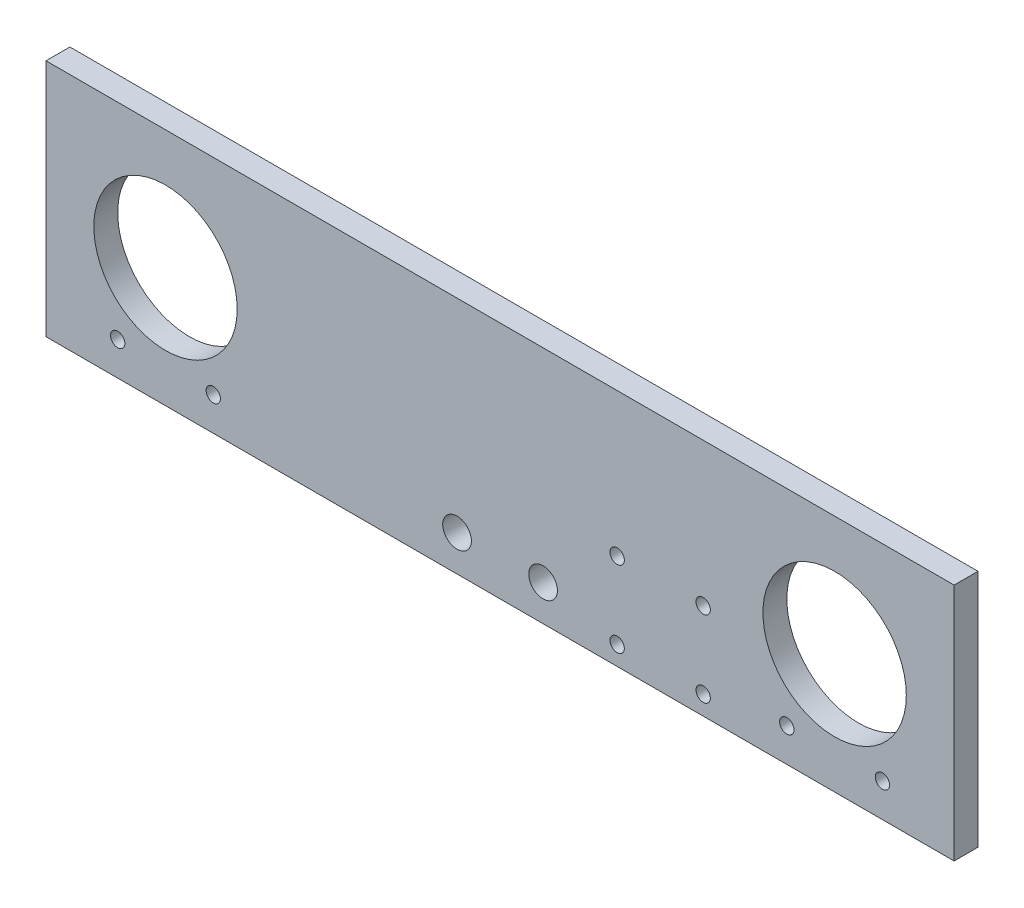
ISO-10303-21;
HEADER;
FILE_DESCRIPTION(('STEP AP214'),'2;1');
FILE_NAME('part.step','',(''),(''),'','','');
FILE_SCHEMA(('AUTOMOTIVE_DESIGN { 1 0 10303 214 1 1 1 1 }'));
ENDSEC;
DATA;
#1=APPLICATION_CONTEXT('core data for automotive mechanical design processes');
#2=APPLICATION_PROTOCOL_DEFINITION('international standard','automotive_design',2000,#1);
#3=PRODUCT_CONTEXT('',#1,'mechanical');
#4=PRODUCT('Part','Part','',(#3));
#5=PRODUCT_RELATED_PRODUCT_CATEGORY('part','',(#4));
#6=PRODUCT_DEFINITION_FORMATION('','',#4);
#7=PRODUCT_DEFINITION_CONTEXT('part definition',#1,'design');
#8=PRODUCT_DEFINITION('design','',#6,#7);
#9=PRODUCT_DEFINITION_SHAPE('','',#8);
#10=(LENGTH_UNIT() NAMED_UNIT(*) SI_UNIT(.MILLI.,.METRE.));
#11=(NAMED_UNIT(*) PLANE_ANGLE_UNIT() SI_UNIT($,.RADIAN.));
#12=(NAMED_UNIT(*) SI_UNIT($,.STERADIAN.) SOLID_ANGLE_UNIT());
#13=UNCERTAINTY_MEASURE_WITH_UNIT(LENGTH_MEASURE(1.E-05),#10,'distance_accuracy_value','');
#14=(GEOMETRIC_REPRESENTATION_CONTEXT(3) GLOBAL_UNCERTAINTY_ASSIGNED_CONTEXT((#13)) GLOBAL_UNIT_ASSIGNED_CONTEXT((#10,
#11,#12)) REPRESENTATION_CONTEXT('',''));
#15=CARTESIAN_POINT('',(0.,0.,0.));
#16=DIRECTION('',(0.,0.,1.));
#17=DIRECTION('',(1.,0.,0.));
#18=AXIS2_PLACEMENT_3D('',#15,#16,#17);
#19=CARTESIAN_POINT('',(0.,0.,0.));
#20=DIRECTION('',(0.,0.,1.));
#21=DIRECTION('',(1.,0.,0.));
#22=AXIS2_PLACEMENT_3D('',#19,#20,#21);
#23=PLANE('',#22);
#24=CARTESIAN_POINT('',(155.,7.,0.));
#25=DIRECTION('',(0.,0.,1.));
#26=DIRECTION('',(1.,0.,0.));
#27=AXIS2_PLACEMENT_3D('',#24,#25,#26);
#28=CIRCLE('',#27,2.75000000000001);
#29=CARTESIAN_POINT('',(157.75,7.,0.));
#30=VERTEX_POINT('',#29);
#31=EDGE_CURVE('E154',#30,#30,#28,.T.);
#32=ORIENTED_EDGE('',*,*,#31,.T.);
#33=EDGE_LOOP('',(#32));
#34=FACE_BOUND('',#33,.T.);
#35=CARTESIAN_POINT('',(15.,7.,0.));
#36=DIRECTION('',(0.,0.,1.));
#37=DIRECTION('',(1.,0.,0.));
#38=AXIS2_PLACEMENT_3D('',#35,#36,#37);
#39=CIRCLE('',#38,2.75);
#40=CARTESIAN_POINT('',(17.75,7.,0.));
#41=VERTEX_POINT('',#40);
#42=EDGE_CURVE('E143',#41,#41,#39,.T.);
#43=ORIENTED_EDGE('',*,*,#42,.T.);
#44=EDGE_LOOP('',(#43));
#45=FACE_BOUND('',#44,.T.);
#46=CARTESIAN_POINT('',(137.5,20.,0.));
#47=DIRECTION('',(0.,0.,1.));
#48=DIRECTION('',(1.,0.,0.));
#49=AXIS2_PLACEMENT_3D('',#46,#47,#48);
#50=CIRCLE('',#49,1.5);
#51=CARTESIAN_POINT('',(139.,20.,0.));
#52=VERTEX_POINT('',#51);
#53=EDGE_CURVE('E102',#52,#52,#50,.T.);
#54=ORIENTED_EDGE('',*,*,#53,.T.);
#55=EDGE_LOOP('',(#54));
#56=FACE_BOUND('',#55,.T.);
#57=CARTESIAN_POINT('',(119.5,20.,0.));
#58=DIRECTION('',(0.,0.,1.));
#59=DIRECTION('',(1.,0.,0.));
#60=AXIS2_PLACEMENT_3D('',#57,#58,#59);
#61=CIRCLE('',#60,1.5);
#62=CARTESIAN_POINT('',(121.,20.,0.));
#63=VERTEX_POINT('',#62);
#64=EDGE_CURVE('E105',#63,#63,#61,.T.);
#65=ORIENTED_EDGE('',*,*,#64,.T.);
#66=EDGE_LOOP('',(#65));
#67=FACE_BOUND('',#66,.T.);
#68=CARTESIAN_POINT('',(119.5,4.,0.));
#69=DIRECTION('',(0.,0.,1.));
#70=DIRECTION('',(1.,0.,0.));
#71=AXIS2_PLACEMENT_3D('',#68,#69,#70);
#72=CIRCLE('',#71,1.5);
#73=CARTESIAN_POINT('',(121.,4.,0.));
#74=VERTEX_POINT('',#73);
#75=EDGE_CURVE('E109',#74,#74,#72,.T.);
#76=ORIENTED_EDGE('',*,*,#75,.T.);
#77=EDGE_LOOP('',(#76));
#78=FACE_BOUND('',#77,.T.);
#79=CARTESIAN_POINT('',(104.,7.5,0.));
#80=DIRECTION('',(0.,0.,1.));
#81=DIRECTION('',(1.,0.,0.));
#82=AXIS2_PLACEMENT_3D('',#79,#80,#81);
#83=CIRCLE('',#82,3.00000000000001);
#84=CARTESIAN_POINT('',(107.,7.5,0.));
#85=VERTEX_POINT('',#84);
#86=EDGE_CURVE('E112',#85,#85,#83,.T.);
#87=ORIENTED_EDGE('',*,*,#86,.T.);
#88=EDGE_LOOP('',(#87));
#89=FACE_BOUND('',#88,.T.);
#90=CARTESIAN_POINT('',(86.,7.5,0.));
#91=DIRECTION('',(0.,0.,1.));
#92=DIRECTION('',(1.,0.,0.));
#93=AXIS2_PLACEMENT_3D('',#90,#91,#92);
#94=CIRCLE('',#93,3.00000000000001);
#95=CARTESIAN_POINT('',(89.,7.5,0.));
#96=VERTEX_POINT('',#95);
#97=EDGE_CURVE('E115',#96,#96,#94,.T.);
#98=ORIENTED_EDGE('',*,*,#97,.T.);
#99=EDGE_LOOP('',(#98));
#100=FACE_BOUND('',#99,.T.);
#101=CARTESIAN_POINT('',(137.5,4.,0.));
#102=DIRECTION('',(0.,0.,1.));
#103=DIRECTION('',(1.,0.,0.));
#104=AXIS2_PLACEMENT_3D('',#101,#102,#103);
#105=CIRCLE('',#104,1.5);
#106=CARTESIAN_POINT('',(139.,4.,0.));
#107=VERTEX_POINT('',#106);
#108=EDGE_CURVE('E118',#107,#107,#105,.T.);
#109=ORIENTED_EDGE('',*,*,#108,.T.);
#110=EDGE_LOOP('',(#109));
#111=FACE_BOUND('',#110,.T.);
#112=CARTESIAN_POINT('',(165.,25.,0.));
#113=DIRECTION('',(0.,0.,1.));
#114=DIRECTION('',(1.,0.,0.));
#115=AXIS2_PLACEMENT_3D('',#112,#113,#114);
#116=CIRCLE('',#115,15.);
#117=CARTESIAN_POINT('',(180.,25.,0.));
#118=VERTEX_POINT('',#117);
#119=EDGE_CURVE('E121',#118,#118,#116,.T.);
#120=ORIENTED_EDGE('',*,*,#119,.T.);
#121=EDGE_LOOP('',(#120));
#122=FACE_BOUND('',#121,.T.);
#123=CARTESIAN_POINT('',(25.,25.,0.));
#124=DIRECTION('',(0.,0.,1.));
#125=DIRECTION('',(1.,0.,0.));
#126=AXIS2_PLACEMENT_3D('',#123,#124,#125);
#127=CIRCLE('',#126,15.);
#128=CARTESIAN_POINT('',(40.,25.,0.));
#129=VERTEX_POINT('',#128);
#130=EDGE_CURVE('E124',#129,#129,#127,.T.);
#131=ORIENTED_EDGE('',*,*,#130,.T.);
#132=EDGE_LOOP('',(#131));
#133=FACE_BOUND('',#132,.T.);
#134=DIRECTION('',(1.,0.,0.));
#135=VECTOR('',#134,1.);
#136=CARTESIAN_POINT('',(0.,0.,0.));
#137=LINE('',#136,#135);
#138=CARTESIAN_POINT('',(0.,0.,0.));
#139=VERTEX_POINT('',#138);
#140=CARTESIAN_POINT('',(190.,0.,0.));
#141=VERTEX_POINT('',#140);
#142=EDGE_CURVE('E127',#139,#141,#137,.T.);
#143=ORIENTED_EDGE('',*,*,#142,.F.);
#144=DIRECTION('',(0.,1.,0.));
#145=VECTOR('',#144,1.);
#146=CARTESIAN_POINT('',(0.,0.,0.));
#147=LINE('',#146,#145);
#148=CARTESIAN_POINT('',(0.,50.,0.));
#149=VERTEX_POINT('',#148);
#150=EDGE_CURVE('E132',#139,#149,#147,.T.);
#151=ORIENTED_EDGE('',*,*,#150,.T.);
#152=DIRECTION('',(1.,0.,0.));
#153=VECTOR('',#152,1.);
#154=CARTESIAN_POINT('',(0.,50.,0.));
#155=LINE('',#154,#153);
#156=CARTESIAN_POINT('',(190.,50.0000000000002,0.));
#157=VERTEX_POINT('',#156);
#158=EDGE_CURVE('E130',#149,#157,#155,.T.);
#159=ORIENTED_EDGE('',*,*,#158,.T.);
#160=DIRECTION('',(0.,1.,0.));
#161=VECTOR('',#160,1.);
#162=CARTESIAN_POINT('',(190.,0.,0.));
#163=LINE('',#162,#161);
#164=EDGE_CURVE('E92',#141,#157,#163,.T.);
#165=ORIENTED_EDGE('',*,*,#164,.F.);
#166=EDGE_LOOP('',(#143,#151,#159,#165));
#167=FACE_BOUND('',#166,.T.);
#168=CARTESIAN_POINT('',(35.,7.,0.));
#169=DIRECTION('',(0.,0.,1.));
#170=DIRECTION('',(1.,0.,0.));
#171=AXIS2_PLACEMENT_3D('',#168,#169,#170);
#172=CIRCLE('',#171,2.75);
#173=CARTESIAN_POINT('',(37.75,7.,0.));
#174=VERTEX_POINT('',#173);
#175=EDGE_CURVE('E147',#174,#174,#172,.T.);
#176=ORIENTED_EDGE('',*,*,#175,.T.);
#177=EDGE_LOOP('',(#176));
#178=FACE_BOUND('',#177,.T.);
#179=CARTESIAN_POINT('',(175.,7.,0.));
#180=DIRECTION('',(0.,0.,1.));
#181=DIRECTION('',(1.,0.,0.));
#182=AXIS2_PLACEMENT_3D('',#179,#180,#181);
#183=CIRCLE('',#182,2.75000000000001);
#184=CARTESIAN_POINT('',(177.75,7.,0.));
#185=VERTEX_POINT('',#184);
#186=EDGE_CURVE('E161',#185,#185,#183,.T.);
#187=ORIENTED_EDGE('',*,*,#186,.T.);
#188=EDGE_LOOP('',(#187));
#189=FACE_BOUND('',#188,.T.);
#190=ADVANCED_FACE('F35',(#34,#45,#56,#67,#78,#89,#100,#111,#122,#133,#167,#178,#189),#23,.F.);
#191=CARTESIAN_POINT('',(0.,0.,5.));
#192=DIRECTION('',(0.,1.,0.));
#193=DIRECTION('',(0.,0.,1.));
#194=AXIS2_PLACEMENT_3D('',#191,#192,#193);
#195=PLANE('',#194);
#196=ORIENTED_EDGE('',*,*,#142,.T.);
#197=DIRECTION('',(0.,0.,-1.));
#198=VECTOR('',#197,1.);
#199=CARTESIAN_POINT('',(190.,0.,5.));
#200=LINE('',#199,#198);
#201=CARTESIAN_POINT('',(190.,0.,5.));
#202=VERTEX_POINT('',#201);
#203=EDGE_CURVE('E11',#202,#141,#200,.T.);
#204=ORIENTED_EDGE('',*,*,#203,.F.);
#205=DIRECTION('',(1.,0.,0.));
#206=VECTOR('',#205,1.);
#207=CARTESIAN_POINT('',(0.,0.,5.));
#208=LINE('',#207,#206);
#209=CARTESIAN_POINT('',(0.,0.,5.));
#210=VERTEX_POINT('',#209);
#211=EDGE_CURVE('E87',#210,#202,#208,.T.);
#212=ORIENTED_EDGE('',*,*,#211,.F.);
#213=DIRECTION('',(0.,0.,-1.));
#214=VECTOR('',#213,1.);
#215=CARTESIAN_POINT('',(0.,0.,5.));
#216=LINE('',#215,#214);
#217=EDGE_CURVE('E54',#210,#139,#216,.T.);
#218=ORIENTED_EDGE('',*,*,#217,.T.);
#219=EDGE_LOOP('',(#196,#204,#212,#218));
#220=FACE_BOUND('',#219,.T.);
#221=ADVANCED_FACE('F226',(#220),#195,.F.);
#222=CARTESIAN_POINT('',(190.,0.,5.));
#223=DIRECTION('',(-1.,0.,0.));
#224=DIRECTION('',(0.,0.,1.));
#225=AXIS2_PLACEMENT_3D('',#222,#223,#224);
#226=PLANE('',#225);
#227=ORIENTED_EDGE('',*,*,#164,.T.);
#228=DIRECTION('',(0.,0.,-1.));
#229=VECTOR('',#228,1.);
#230=CARTESIAN_POINT('',(190.,50.0000000000002,5.));
#231=LINE('',#230,#229);
#232=CARTESIAN_POINT('',(190.,50.0000000000002,5.));
#233=VERTEX_POINT('',#232);
#234=EDGE_CURVE('E45',#233,#157,#231,.T.);
#235=ORIENTED_EDGE('',*,*,#234,.F.);
#236=DIRECTION('',(0.,1.,0.));
#237=VECTOR('',#236,1.);
#238=CARTESIAN_POINT('',(190.,0.,5.));
#239=LINE('',#238,#237);
#240=EDGE_CURVE('E79',#202,#233,#239,.T.);
#241=ORIENTED_EDGE('',*,*,#240,.F.);
#242=ORIENTED_EDGE('',*,*,#203,.T.);
#243=EDGE_LOOP('',(#227,#235,#241,#242));
#244=FACE_BOUND('',#243,.T.);
#245=ADVANCED_FACE('F91',(#244),#226,.F.);
#246=CARTESIAN_POINT('',(0.,50.,5.));
#247=DIRECTION('',(0.,1.,0.));
#248=DIRECTION('',(-1.,0.,0.));
#249=AXIS2_PLACEMENT_3D('',#246,#247,#248);
#250=PLANE('',#249);
#251=ORIENTED_EDGE('',*,*,#158,.F.);
#252=DIRECTION('',(0.,0.,-1.));
#253=VECTOR('',#252,1.);
#254=CARTESIAN_POINT('',(0.,50.,5.));
#255=LINE('',#254,#253);
#256=CARTESIAN_POINT('',(0.,50.,5.));
#257=VERTEX_POINT('',#256);
#258=EDGE_CURVE('E68',#257,#149,#255,.T.);
#259=ORIENTED_EDGE('',*,*,#258,.F.);
#260=DIRECTION('',(1.,0.,0.));
#261=VECTOR('',#260,1.);
#262=CARTESIAN_POINT('',(0.,50.,5.));
#263=LINE('',#262,#261);
#264=EDGE_CURVE('E86',#257,#233,#263,.T.);
#265=ORIENTED_EDGE('',*,*,#264,.T.);
#266=ORIENTED_EDGE('',*,*,#234,.T.);
#267=EDGE_LOOP('',(#251,#259,#265,#266));
#268=FACE_BOUND('',#267,.T.);
#269=ADVANCED_FACE('F96',(#268),#250,.T.);
#270=CARTESIAN_POINT('',(25.,25.,5.));
#271=DIRECTION('',(0.,0.,-1.));
#272=DIRECTION('',(-1.,0.,0.));
#273=AXIS2_PLACEMENT_3D('',#270,#271,#272);
#274=CYLINDRICAL_SURFACE('',#273,15.);
#275=CARTESIAN_POINT('',(25.,25.,5.));
#276=DIRECTION('',(0.,0.,1.));
#277=DIRECTION('',(1.,0.,0.));
#278=AXIS2_PLACEMENT_3D('',#275,#276,#277);
#279=CIRCLE('',#278,15.);
#280=CARTESIAN_POINT('',(40.,25.,5.));
#281=VERTEX_POINT('',#280);
#282=EDGE_CURVE('E202',#281,#281,#279,.T.);
#283=ORIENTED_EDGE('',*,*,#282,.T.);
#284=EDGE_LOOP('',(#283));
#285=FACE_BOUND('',#284,.T.);
#286=ORIENTED_EDGE('',*,*,#130,.F.);
#287=EDGE_LOOP('',(#286));
#288=FACE_BOUND('',#287,.T.);
#289=ADVANCED_FACE('F206',(#285,#288),#274,.F.);
#290=CARTESIAN_POINT('',(165.,25.,5.));
#291=DIRECTION('',(0.,0.,-1.));
#292=DIRECTION('',(-1.,0.,0.));
#293=AXIS2_PLACEMENT_3D('',#290,#291,#292);
#294=CYLINDRICAL_SURFACE('',#293,15.);
#295=CARTESIAN_POINT('',(165.,25.,5.));
#296=DIRECTION('',(0.,0.,1.));
#297=DIRECTION('',(1.,0.,0.));
#298=AXIS2_PLACEMENT_3D('',#295,#296,#297);
#299=CIRCLE('',#298,15.);
#300=CARTESIAN_POINT('',(180.,25.,5.));
#301=VERTEX_POINT('',#300);
#302=EDGE_CURVE('E199',#301,#301,#299,.T.);
#303=ORIENTED_EDGE('',*,*,#302,.T.);
#304=EDGE_LOOP('',(#303));
#305=FACE_BOUND('',#304,.T.);
#306=ORIENTED_EDGE('',*,*,#119,.F.);
#307=EDGE_LOOP('',(#306));
#308=FACE_BOUND('',#307,.T.);
#309=ADVANCED_FACE('F240',(#305,#308),#294,.F.);
#310=CARTESIAN_POINT('',(35.,7.,5.));
#311=DIRECTION('',(0.,0.,-1.));
#312=DIRECTION('',(-1.,0.,0.));
#313=AXIS2_PLACEMENT_3D('',#310,#311,#312);
#314=CYLINDRICAL_SURFACE('',#313,1.5);
#315=CARTESIAN_POINT('',(35.,7.,1.5));
#316=DIRECTION('',(0.,0.,1.));
#317=DIRECTION('',(1.,0.,0.));
#318=AXIS2_PLACEMENT_3D('',#315,#316,#317);
#319=CIRCLE('',#318,1.5);
#320=CARTESIAN_POINT('',(36.5,7.,1.5));
#321=VERTEX_POINT('',#320);
#322=EDGE_CURVE('E141',#321,#321,#319,.T.);
#323=ORIENTED_EDGE('',*,*,#322,.F.);
#324=EDGE_LOOP('',(#323));
#325=FACE_BOUND('',#324,.T.);
#326=CARTESIAN_POINT('',(35.,7.,5.));
#327=DIRECTION('',(0.,0.,1.));
#328=DIRECTION('',(1.,0.,0.));
#329=AXIS2_PLACEMENT_3D('',#326,#327,#328);
#330=CIRCLE('',#329,1.5);
#331=CARTESIAN_POINT('',(36.5,7.,5.));
#332=VERTEX_POINT('',#331);
#333=EDGE_CURVE('E196',#332,#332,#330,.T.);
#334=ORIENTED_EDGE('',*,*,#333,.T.);
#335=EDGE_LOOP('',(#334));
#336=FACE_BOUND('',#335,.T.);
#337=ADVANCED_FACE('F243',(#325,#336),#314,.F.);
#338=CARTESIAN_POINT('',(175.,7.,5.));
#339=DIRECTION('',(0.,0.,-1.));
#340=DIRECTION('',(-1.,0.,0.));
#341=AXIS2_PLACEMENT_3D('',#338,#339,#340);
#342=CYLINDRICAL_SURFACE('',#341,1.5);
#343=CARTESIAN_POINT('',(175.,7.,1.5));
#344=DIRECTION('',(0.,0.,1.));
#345=DIRECTION('',(1.,0.,0.));
#346=AXIS2_PLACEMENT_3D('',#343,#344,#345);
#347=CIRCLE('',#346,1.5);
#348=CARTESIAN_POINT('',(176.5,7.,1.5));
#349=VERTEX_POINT('',#348);
#350=EDGE_CURVE('E39',#349,#349,#347,.T.);
#351=ORIENTED_EDGE('',*,*,#350,.F.);
#352=EDGE_LOOP('',(#351));
#353=FACE_BOUND('',#352,.T.);
#354=CARTESIAN_POINT('',(175.,7.,5.));
#355=DIRECTION('',(0.,0.,1.));
#356=DIRECTION('',(1.,0.,0.));
#357=AXIS2_PLACEMENT_3D('',#354,#355,#356);
#358=CIRCLE('',#357,1.5);
#359=CARTESIAN_POINT('',(176.5,7.,5.));
#360=VERTEX_POINT('',#359);
#361=EDGE_CURVE('E193',#360,#360,#358,.T.);
#362=ORIENTED_EDGE('',*,*,#361,.T.);
#363=EDGE_LOOP('',(#362));
#364=FACE_BOUND('',#363,.T.);
#365=ADVANCED_FACE('F247',(#353,#364),#342,.F.);
#366=CARTESIAN_POINT('',(155.,7.,5.));
#367=DIRECTION('',(0.,0.,-1.));
#368=DIRECTION('',(-1.,0.,0.));
#369=AXIS2_PLACEMENT_3D('',#366,#367,#368);
#370=CYLINDRICAL_SURFACE('',#369,1.5);
#371=CARTESIAN_POINT('',(155.,7.,1.5));
#372=DIRECTION('',(0.,0.,1.));
#373=DIRECTION('',(1.,0.,0.));
#374=AXIS2_PLACEMENT_3D('',#371,#372,#373);
#375=CIRCLE('',#374,1.5);
#376=CARTESIAN_POINT('',(156.5,7.,1.5));
#377=VERTEX_POINT('',#376);
#378=EDGE_CURVE('E145',#377,#377,#375,.T.);
#379=ORIENTED_EDGE('',*,*,#378,.F.);
#380=EDGE_LOOP('',(#379));
#381=FACE_BOUND('',#380,.T.);
#382=CARTESIAN_POINT('',(155.,7.,5.));
#383=DIRECTION('',(0.,0.,1.));
#384=DIRECTION('',(1.,0.,0.));
#385=AXIS2_PLACEMENT_3D('',#382,#383,#384);
#386=CIRCLE('',#385,1.5);
#387=CARTESIAN_POINT('',(156.5,7.,5.));
#388=VERTEX_POINT('',#387);
#389=EDGE_CURVE('E190',#388,#388,#386,.T.);
#390=ORIENTED_EDGE('',*,*,#389,.T.);
#391=EDGE_LOOP('',(#390));
#392=FACE_BOUND('',#391,.T.);
#393=ADVANCED_FACE('F251',(#381,#392),#370,.F.);
#394=CARTESIAN_POINT('',(137.5,4.,5.));
#395=DIRECTION('',(0.,0.,-1.));
#396=DIRECTION('',(-1.,0.,0.));
#397=AXIS2_PLACEMENT_3D('',#394,#395,#396);
#398=CYLINDRICAL_SURFACE('',#397,1.5);
#399=CARTESIAN_POINT('',(137.5,4.,5.));
#400=DIRECTION('',(0.,0.,1.));
#401=DIRECTION('',(1.,0.,0.));
#402=AXIS2_PLACEMENT_3D('',#399,#400,#401);
#403=CIRCLE('',#402,1.5);
#404=CARTESIAN_POINT('',(139.,4.,5.));
#405=VERTEX_POINT('',#404);
#406=EDGE_CURVE('E187',#405,#405,#403,.T.);
#407=ORIENTED_EDGE('',*,*,#406,.T.);
#408=EDGE_LOOP('',(#407));
#409=FACE_BOUND('',#408,.T.);
#410=ORIENTED_EDGE('',*,*,#108,.F.);
#411=EDGE_LOOP('',(#410));
#412=FACE_BOUND('',#411,.T.);
#413=ADVANCED_FACE('F255',(#409,#412),#398,.F.);
#414=CARTESIAN_POINT('',(86.,7.5,5.));
#415=DIRECTION('',(0.,0.,-1.));
#416=DIRECTION('',(-1.,0.,0.));
#417=AXIS2_PLACEMENT_3D('',#414,#415,#416);
#418=CYLINDRICAL_SURFACE('',#417,3.00000000000001);
#419=CARTESIAN_POINT('',(86.,7.5,5.));
#420=DIRECTION('',(0.,0.,1.));
#421=DIRECTION('',(1.,0.,0.));
#422=AXIS2_PLACEMENT_3D('',#419,#420,#421);
#423=CIRCLE('',#422,3.00000000000001);
#424=CARTESIAN_POINT('',(89.,7.5,5.));
#425=VERTEX_POINT('',#424);
#426=EDGE_CURVE('E184',#425,#425,#423,.T.);
#427=ORIENTED_EDGE('',*,*,#426,.T.);
#428=EDGE_LOOP('',(#427));
#429=FACE_BOUND('',#428,.T.);
#430=ORIENTED_EDGE('',*,*,#97,.F.);
#431=EDGE_LOOP('',(#430));
#432=FACE_BOUND('',#431,.T.);
#433=ADVANCED_FACE('F259',(#429,#432),#418,.F.);
#434=CARTESIAN_POINT('',(104.,7.5,5.));
#435=DIRECTION('',(0.,0.,-1.));
#436=DIRECTION('',(-1.,0.,0.));
#437=AXIS2_PLACEMENT_3D('',#434,#435,#436);
#438=CYLINDRICAL_SURFACE('',#437,3.00000000000001);
#439=CARTESIAN_POINT('',(104.,7.5,5.));
#440=DIRECTION('',(0.,0.,1.));
#441=DIRECTION('',(1.,0.,0.));
#442=AXIS2_PLACEMENT_3D('',#439,#440,#441);
#443=CIRCLE('',#442,3.00000000000001);
#444=CARTESIAN_POINT('',(107.,7.5,5.));
#445=VERTEX_POINT('',#444);
#446=EDGE_CURVE('E181',#445,#445,#443,.T.);
#447=ORIENTED_EDGE('',*,*,#446,.T.);
#448=EDGE_LOOP('',(#447));
#449=FACE_BOUND('',#448,.T.);
#450=ORIENTED_EDGE('',*,*,#86,.F.);
#451=EDGE_LOOP('',(#450));
#452=FACE_BOUND('',#451,.T.);
#453=ADVANCED_FACE('F263',(#449,#452),#438,.F.);
#454=CARTESIAN_POINT('',(15.,7.,5.));
#455=DIRECTION('',(0.,0.,-1.));
#456=DIRECTION('',(-1.,0.,0.));
#457=AXIS2_PLACEMENT_3D('',#454,#455,#456);
#458=CYLINDRICAL_SURFACE('',#457,1.5);
#459=CARTESIAN_POINT('',(15.,7.,1.5));
#460=DIRECTION('',(0.,0.,1.));
#461=DIRECTION('',(1.,0.,0.));
#462=AXIS2_PLACEMENT_3D('',#459,#460,#461);
#463=CIRCLE('',#462,1.5);
#464=CARTESIAN_POINT('',(16.5,7.,1.5));
#465=VERTEX_POINT('',#464);
#466=EDGE_CURVE('E106',#465,#465,#463,.T.);
#467=ORIENTED_EDGE('',*,*,#466,.F.);
#468=EDGE_LOOP('',(#467));
#469=FACE_BOUND('',#468,.T.);
#470=CARTESIAN_POINT('',(15.,7.,5.));
#471=DIRECTION('',(0.,0.,1.));
#472=DIRECTION('',(1.,0.,0.));
#473=AXIS2_PLACEMENT_3D('',#470,#471,#472);
#474=CIRCLE('',#473,1.5);
#475=CARTESIAN_POINT('',(16.5,7.,5.));
#476=VERTEX_POINT('',#475);
#477=EDGE_CURVE('E178',#476,#476,#474,.T.);
#478=ORIENTED_EDGE('',*,*,#477,.T.);
#479=EDGE_LOOP('',(#478));
#480=FACE_BOUND('',#479,.T.);
#481=ADVANCED_FACE('F267',(#469,#480),#458,.F.);
#482=CARTESIAN_POINT('',(119.5,4.,5.));
#483=DIRECTION('',(0.,0.,-1.));
#484=DIRECTION('',(-1.,0.,0.));
#485=AXIS2_PLACEMENT_3D('',#482,#483,#484);
#486=CYLINDRICAL_SURFACE('',#485,1.5);
#487=CARTESIAN_POINT('',(119.5,4.,5.));
#488=DIRECTION('',(0.,0.,1.));
#489=DIRECTION('',(1.,0.,0.));
#490=AXIS2_PLACEMENT_3D('',#487,#488,#489);
#491=CIRCLE('',#490,1.5);
#492=CARTESIAN_POINT('',(121.,4.,5.));
#493=VERTEX_POINT('',#492);
#494=EDGE_CURVE('E175',#493,#493,#491,.T.);
#495=ORIENTED_EDGE('',*,*,#494,.T.);
#496=EDGE_LOOP('',(#495));
#497=FACE_BOUND('',#496,.T.);
#498=ORIENTED_EDGE('',*,*,#75,.F.);
#499=EDGE_LOOP('',(#498));
#500=FACE_BOUND('',#499,.T.);
#501=ADVANCED_FACE('F271',(#497,#500),#486,.F.);
#502=CARTESIAN_POINT('',(119.5,20.,5.));
#503=DIRECTION('',(0.,0.,-1.));
#504=DIRECTION('',(-1.,0.,0.));
#505=AXIS2_PLACEMENT_3D('',#502,#503,#504);
#506=CYLINDRICAL_SURFACE('',#505,1.5);
#507=CARTESIAN_POINT('',(119.5,20.,5.));
#508=DIRECTION('',(0.,0.,1.));
#509=DIRECTION('',(1.,0.,0.));
#510=AXIS2_PLACEMENT_3D('',#507,#508,#509);
#511=CIRCLE('',#510,1.5);
#512=CARTESIAN_POINT('',(121.,20.,5.));
#513=VERTEX_POINT('',#512);
#514=EDGE_CURVE('E172',#513,#513,#511,.T.);
#515=ORIENTED_EDGE('',*,*,#514,.T.);
#516=EDGE_LOOP('',(#515));
#517=FACE_BOUND('',#516,.T.);
#518=ORIENTED_EDGE('',*,*,#64,.F.);
#519=EDGE_LOOP('',(#518));
#520=FACE_BOUND('',#519,.T.);
#521=ADVANCED_FACE('F274',(#517,#520),#506,.F.);
#522=CARTESIAN_POINT('',(137.5,20.,5.));
#523=DIRECTION('',(0.,0.,-1.));
#524=DIRECTION('',(-1.,0.,0.));
#525=AXIS2_PLACEMENT_3D('',#522,#523,#524);
#526=CYLINDRICAL_SURFACE('',#525,1.5);
#527=CARTESIAN_POINT('',(137.5,20.,5.));
#528=DIRECTION('',(0.,0.,1.));
#529=DIRECTION('',(1.,0.,0.));
#530=AXIS2_PLACEMENT_3D('',#527,#528,#529);
#531=CIRCLE('',#530,1.5);
#532=CARTESIAN_POINT('',(139.,20.,5.));
#533=VERTEX_POINT('',#532);
#534=EDGE_CURVE('E135',#533,#533,#531,.T.);
#535=ORIENTED_EDGE('',*,*,#534,.T.);
#536=EDGE_LOOP('',(#535));
#537=FACE_BOUND('',#536,.T.);
#538=ORIENTED_EDGE('',*,*,#53,.F.);
#539=EDGE_LOOP('',(#538));
#540=FACE_BOUND('',#539,.T.);
#541=ADVANCED_FACE('F37',(#537,#540),#526,.F.);
#542=CARTESIAN_POINT('',(0.,0.,5.));
#543=DIRECTION('',(-1.,0.,0.));
#544=DIRECTION('',(0.,0.,1.));
#545=AXIS2_PLACEMENT_3D('',#542,#543,#544);
#546=PLANE('',#545);
#547=ORIENTED_EDGE('',*,*,#150,.F.);
#548=ORIENTED_EDGE('',*,*,#217,.F.);
#549=DIRECTION('',(0.,1.,0.));
#550=VECTOR('',#549,1.);
#551=CARTESIAN_POINT('',(0.,0.,5.));
#552=LINE('',#551,#550);
#553=EDGE_CURVE('E97',#210,#257,#552,.T.);
#554=ORIENTED_EDGE('',*,*,#553,.T.);
#555=ORIENTED_EDGE('',*,*,#258,.T.);
#556=EDGE_LOOP('',(#547,#548,#554,#555));
#557=FACE_BOUND('',#556,.T.);
#558=ADVANCED_FACE('F211',(#557),#546,.T.);
#559=CARTESIAN_POINT('',(0.,0.,5.));
#560=DIRECTION('',(0.,0.,1.));
#561=DIRECTION('',(1.,0.,0.));
#562=AXIS2_PLACEMENT_3D('',#559,#560,#561);
#563=PLANE('',#562);
#564=ORIENTED_EDGE('',*,*,#534,.F.);
#565=EDGE_LOOP('',(#564));
#566=FACE_BOUND('',#565,.T.);
#567=ORIENTED_EDGE('',*,*,#514,.F.);
#568=EDGE_LOOP('',(#567));
#569=FACE_BOUND('',#568,.T.);
#570=ORIENTED_EDGE('',*,*,#494,.F.);
#571=EDGE_LOOP('',(#570));
#572=FACE_BOUND('',#571,.T.);
#573=ORIENTED_EDGE('',*,*,#477,.F.);
#574=EDGE_LOOP('',(#573));
#575=FACE_BOUND('',#574,.T.);
#576=ORIENTED_EDGE('',*,*,#446,.F.);
#577=EDGE_LOOP('',(#576));
#578=FACE_BOUND('',#577,.T.);
#579=ORIENTED_EDGE('',*,*,#426,.F.);
#580=EDGE_LOOP('',(#579));
#581=FACE_BOUND('',#580,.T.);
#582=ORIENTED_EDGE('',*,*,#406,.F.);
#583=EDGE_LOOP('',(#582));
#584=FACE_BOUND('',#583,.T.);
#585=ORIENTED_EDGE('',*,*,#389,.F.);
#586=EDGE_LOOP('',(#585));
#587=FACE_BOUND('',#586,.T.);
#588=ORIENTED_EDGE('',*,*,#361,.F.);
#589=EDGE_LOOP('',(#588));
#590=FACE_BOUND('',#589,.T.);
#591=ORIENTED_EDGE('',*,*,#333,.F.);
#592=EDGE_LOOP('',(#591));
#593=FACE_BOUND('',#592,.T.);
#594=ORIENTED_EDGE('',*,*,#302,.F.);
#595=EDGE_LOOP('',(#594));
#596=FACE_BOUND('',#595,.T.);
#597=ORIENTED_EDGE('',*,*,#282,.F.);
#598=EDGE_LOOP('',(#597));
#599=FACE_BOUND('',#598,.T.);
#600=ORIENTED_EDGE('',*,*,#211,.T.);
#601=ORIENTED_EDGE('',*,*,#240,.T.);
#602=ORIENTED_EDGE('',*,*,#264,.F.);
#603=ORIENTED_EDGE('',*,*,#553,.F.);
#604=EDGE_LOOP('',(#600,#601,#602,#603));
#605=FACE_BOUND('',#604,.T.);
#606=ADVANCED_FACE('F83',(#566,#569,#572,#575,#578,#581,#584,#587,#590,#593,#596,#599,#605),
#563,.T.);
#607=CARTESIAN_POINT('',(15.,7.,1.5));
#608=DIRECTION('',(0.,0.,-1.));
#609=DIRECTION('',(-1.,0.,0.));
#610=AXIS2_PLACEMENT_3D('',#607,#608,#609);
#611=CYLINDRICAL_SURFACE('',#610,2.75);
#612=CARTESIAN_POINT('',(15.,7.,1.5));
#613=DIRECTION('',(0.,0.,1.));
#614=DIRECTION('',(1.,0.,0.));
#615=AXIS2_PLACEMENT_3D('',#612,#613,#614);
#616=CIRCLE('',#615,2.75);
#617=CARTESIAN_POINT('',(17.75,7.,1.5));
#618=VERTEX_POINT('',#617);
#619=EDGE_CURVE('E140',#618,#618,#616,.T.);
#620=ORIENTED_EDGE('',*,*,#619,.T.);
#621=EDGE_LOOP('',(#620));
#622=FACE_BOUND('',#621,.T.);
#623=ORIENTED_EDGE('',*,*,#42,.F.);
#624=EDGE_LOOP('',(#623));
#625=FACE_BOUND('',#624,.T.);
#626=ADVANCED_FACE('F210',(#622,#625),#611,.F.);
#627=CARTESIAN_POINT('',(15.,7.,1.5));
#628=DIRECTION('',(0.,0.,1.));
#629=DIRECTION('',(1.,0.,0.));
#630=AXIS2_PLACEMENT_3D('',#627,#628,#629);
#631=PLANE('',#630);
#632=ORIENTED_EDGE('',*,*,#466,.T.);
#633=EDGE_LOOP('',(#632));
#634=FACE_BOUND('',#633,.T.);
#635=ORIENTED_EDGE('',*,*,#619,.F.);
#636=EDGE_LOOP('',(#635));
#637=FACE_BOUND('',#636,.T.);
#638=ADVANCED_FACE('F218',(#634,#637),#631,.F.);
#639=CARTESIAN_POINT('',(35.,7.,1.5));
#640=DIRECTION('',(0.,0.,-1.));
#641=DIRECTION('',(-1.,0.,0.));
#642=AXIS2_PLACEMENT_3D('',#639,#640,#641);
#643=CYLINDRICAL_SURFACE('',#642,2.75);
#644=CARTESIAN_POINT('',(35.,7.,1.5));
#645=DIRECTION('',(0.,0.,1.));
#646=DIRECTION('',(1.,0.,0.));
#647=AXIS2_PLACEMENT_3D('',#644,#645,#646);
#648=CIRCLE('',#647,2.75);
#649=CARTESIAN_POINT('',(37.75,7.,1.5));
#650=VERTEX_POINT('',#649);
#651=EDGE_CURVE('E144',#650,#650,#648,.T.);
#652=ORIENTED_EDGE('',*,*,#651,.T.);
#653=EDGE_LOOP('',(#652));
#654=FACE_BOUND('',#653,.T.);
#655=ORIENTED_EDGE('',*,*,#175,.F.);
#656=EDGE_LOOP('',(#655));
#657=FACE_BOUND('',#656,.T.);
#658=ADVANCED_FACE('F340',(#654,#657),#643,.F.);
#659=CARTESIAN_POINT('',(35.,7.,1.5));
#660=DIRECTION('',(0.,0.,1.));
#661=DIRECTION('',(1.,0.,0.));
#662=AXIS2_PLACEMENT_3D('',#659,#660,#661);
#663=PLANE('',#662);
#664=ORIENTED_EDGE('',*,*,#322,.T.);
#665=EDGE_LOOP('',(#664));
#666=FACE_BOUND('',#665,.T.);
#667=ORIENTED_EDGE('',*,*,#651,.F.);
#668=EDGE_LOOP('',(#667));
#669=FACE_BOUND('',#668,.T.);
#670=ADVANCED_FACE('F337',(#666,#669),#663,.F.);
#671=CARTESIAN_POINT('',(155.,7.,1.5));
#672=DIRECTION('',(0.,0.,-1.));
#673=DIRECTION('',(-1.,0.,0.));
#674=AXIS2_PLACEMENT_3D('',#671,#672,#673);
#675=CYLINDRICAL_SURFACE('',#674,2.75000000000001);
#676=CARTESIAN_POINT('',(155.,7.,1.5));
#677=DIRECTION('',(0.,0.,1.));
#678=DIRECTION('',(1.,0.,0.));
#679=AXIS2_PLACEMENT_3D('',#676,#677,#678);
#680=CIRCLE('',#679,2.75000000000001);
#681=CARTESIAN_POINT('',(157.75,7.,1.5));
#682=VERTEX_POINT('',#681);
#683=EDGE_CURVE('E148',#682,#682,#680,.T.);
#684=ORIENTED_EDGE('',*,*,#683,.T.);
#685=EDGE_LOOP('',(#684));
#686=FACE_BOUND('',#685,.T.);
#687=ORIENTED_EDGE('',*,*,#31,.F.);
#688=EDGE_LOOP('',(#687));
#689=FACE_BOUND('',#688,.T.);
#690=ADVANCED_FACE('F334',(#686,#689),#675,.F.);
#691=CARTESIAN_POINT('',(155.,7.,1.5));
#692=DIRECTION('',(0.,0.,1.));
#693=DIRECTION('',(1.,0.,0.));
#694=AXIS2_PLACEMENT_3D('',#691,#692,#693);
#695=PLANE('',#694);
#696=ORIENTED_EDGE('',*,*,#378,.T.);
#697=EDGE_LOOP('',(#696));
#698=FACE_BOUND('',#697,.T.);
#699=ORIENTED_EDGE('',*,*,#683,.F.);
#700=EDGE_LOOP('',(#699));
#701=FACE_BOUND('',#700,.T.);
#702=ADVANCED_FACE('F329',(#698,#701),#695,.F.);
#703=CARTESIAN_POINT('',(175.,7.,1.5));
#704=DIRECTION('',(0.,0.,-1.));
#705=DIRECTION('',(-1.,0.,0.));
#706=AXIS2_PLACEMENT_3D('',#703,#704,#705);
#707=CYLINDRICAL_SURFACE('',#706,2.75000000000001);
#708=CARTESIAN_POINT('',(175.,7.,1.5));
#709=DIRECTION('',(0.,0.,1.));
#710=DIRECTION('',(1.,0.,0.));
#711=AXIS2_PLACEMENT_3D('',#708,#709,#710);
#712=CIRCLE('',#711,2.75000000000001);
#713=CARTESIAN_POINT('',(177.75,7.,1.5));
#714=VERTEX_POINT('',#713);
#715=EDGE_CURVE('E305',#714,#714,#712,.T.);
#716=ORIENTED_EDGE('',*,*,#715,.T.);
#717=EDGE_LOOP('',(#716));
#718=FACE_BOUND('',#717,.T.);
#719=ORIENTED_EDGE('',*,*,#186,.F.);
#720=EDGE_LOOP('',(#719));
#721=FACE_BOUND('',#720,.T.);
#722=ADVANCED_FACE('F324',(#718,#721),#707,.F.);
#723=CARTESIAN_POINT('',(175.,7.,1.5));
#724=DIRECTION('',(0.,0.,1.));
#725=DIRECTION('',(1.,0.,0.));
#726=AXIS2_PLACEMENT_3D('',#723,#724,#725);
#727=PLANE('',#726);
#728=ORIENTED_EDGE('',*,*,#350,.T.);
#729=EDGE_LOOP('',(#728));
#730=FACE_BOUND('',#729,.T.);
#731=ORIENTED_EDGE('',*,*,#715,.F.);
#732=EDGE_LOOP('',(#731));
#733=FACE_BOUND('',#732,.T.);
#734=ADVANCED_FACE('F312',(#730,#733),#727,.F.);
#735=CLOSED_SHELL('',(#190,#221,#245,#269,#289,#309,#337,#365,#393,#413,#433,#453,#481,#501,
#521,#541,#558,#606,#626,#638,#658,#670,#690,#702,#722,#734));
#736=MANIFOLD_SOLID_BREP('B2',#735);
#737=ADVANCED_BREP_SHAPE_REPRESENTATION('',(#18,#736),#14);
#738=SHAPE_DEFINITION_REPRESENTATION(#9,#737);
ENDSEC;
END-ISO-10303-21;
